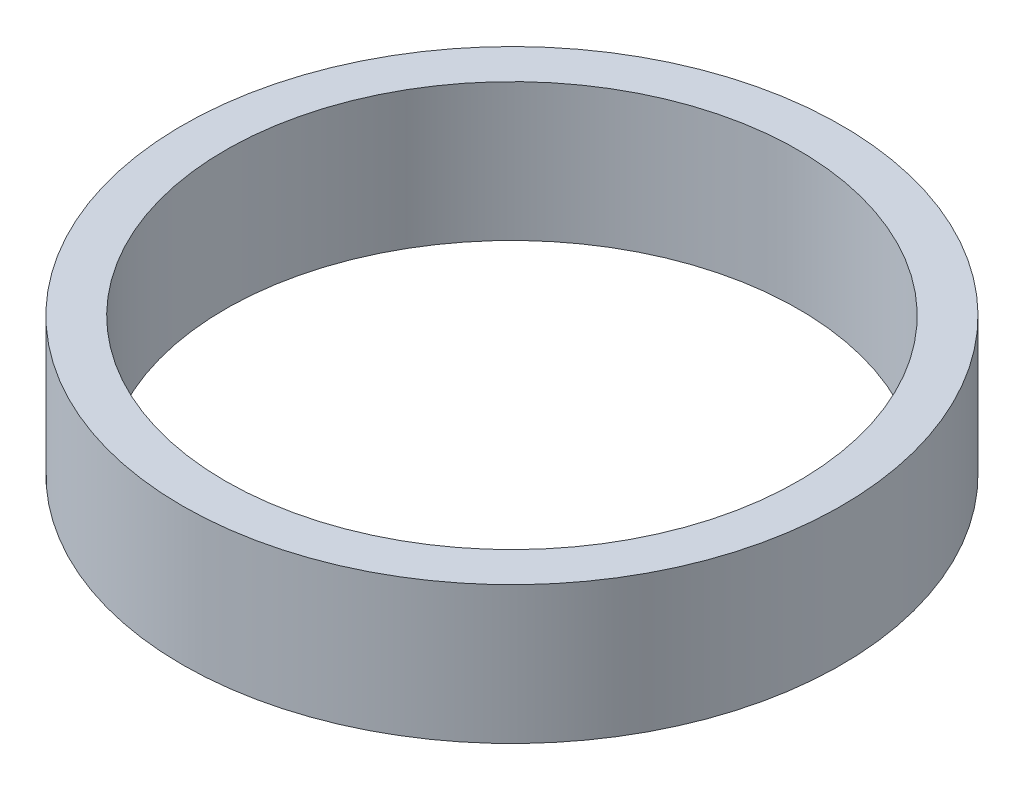
ISO-10303-21;
HEADER;
FILE_DESCRIPTION(('STEP AP214'),'2;1');
FILE_NAME('part.step','',(''),(''),'','','');
FILE_SCHEMA(('AUTOMOTIVE_DESIGN { 1 0 10303 214 1 1 1 1 }'));
ENDSEC;
DATA;
#1=APPLICATION_CONTEXT('core data for automotive mechanical design processes');
#2=APPLICATION_PROTOCOL_DEFINITION('international standard','automotive_design',2000,#1);
#3=PRODUCT_CONTEXT('',#1,'mechanical');
#4=PRODUCT('Part','Part','',(#3));
#5=PRODUCT_RELATED_PRODUCT_CATEGORY('part','',(#4));
#6=PRODUCT_DEFINITION_FORMATION('','',#4);
#7=PRODUCT_DEFINITION_CONTEXT('part definition',#1,'design');
#8=PRODUCT_DEFINITION('design','',#6,#7);
#9=PRODUCT_DEFINITION_SHAPE('','',#8);
#10=(LENGTH_UNIT() NAMED_UNIT(*) SI_UNIT(.MILLI.,.METRE.));
#11=(NAMED_UNIT(*) PLANE_ANGLE_UNIT() SI_UNIT($,.RADIAN.));
#12=(NAMED_UNIT(*) SI_UNIT($,.STERADIAN.) SOLID_ANGLE_UNIT());
#13=UNCERTAINTY_MEASURE_WITH_UNIT(LENGTH_MEASURE(1.E-05),#10,'distance_accuracy_value','');
#14=(GEOMETRIC_REPRESENTATION_CONTEXT(3) GLOBAL_UNCERTAINTY_ASSIGNED_CONTEXT((#13)) GLOBAL_UNIT_ASSIGNED_CONTEXT((#10,
#11,#12)) REPRESENTATION_CONTEXT('',''));
#15=CARTESIAN_POINT('',(0.,0.,0.));
#16=DIRECTION('',(0.,0.,1.));
#17=DIRECTION('',(1.,0.,0.));
#18=AXIS2_PLACEMENT_3D('',#15,#16,#17);
#19=CARTESIAN_POINT('',(0.,24.,0.));
#20=DIRECTION('',(0.,-1.,0.));
#21=DIRECTION('',(0.,0.,-1.));
#22=AXIS2_PLACEMENT_3D('',#19,#20,#21);
#23=CYLINDRICAL_SURFACE('',#22,57.5);
#24=CARTESIAN_POINT('',(0.,24.,0.));
#25=DIRECTION('',(0.,1.,0.));
#26=DIRECTION('',(0.,0.,1.));
#27=AXIS2_PLACEMENT_3D('',#24,#25,#26);
#28=CIRCLE('',#27,57.5);
#29=CARTESIAN_POINT('',(0.,24.,57.5));
#30=VERTEX_POINT('',#29);
#31=EDGE_CURVE('E10',#30,#30,#28,.T.);
#32=ORIENTED_EDGE('',*,*,#31,.F.);
#33=EDGE_LOOP('',(#32));
#34=FACE_BOUND('',#33,.T.);
#35=CARTESIAN_POINT('',(0.,0.,0.));
#36=DIRECTION('',(0.,1.,0.));
#37=DIRECTION('',(0.,0.,1.));
#38=AXIS2_PLACEMENT_3D('',#35,#36,#37);
#39=CIRCLE('',#38,57.5);
#40=CARTESIAN_POINT('',(0.,0.,57.5));
#41=VERTEX_POINT('',#40);
#42=EDGE_CURVE('E37',#41,#41,#39,.T.);
#43=ORIENTED_EDGE('',*,*,#42,.T.);
#44=EDGE_LOOP('',(#43));
#45=FACE_BOUND('',#44,.T.);
#46=ADVANCED_FACE('F40',(#34,#45),#23,.T.);
#47=CARTESIAN_POINT('',(0.,24.,0.));
#48=DIRECTION('',(0.,1.,0.));
#49=DIRECTION('',(0.,0.,1.));
#50=AXIS2_PLACEMENT_3D('',#47,#48,#49);
#51=PLANE('',#50);
#52=CARTESIAN_POINT('',(0.,24.,0.));
#53=DIRECTION('',(0.,1.,0.));
#54=DIRECTION('',(0.,0.,1.));
#55=AXIS2_PLACEMENT_3D('',#52,#53,#54);
#56=CIRCLE('',#55,50.);
#57=CARTESIAN_POINT('',(0.,24.,50.));
#58=VERTEX_POINT('',#57);
#59=EDGE_CURVE('E50',#58,#58,#56,.T.);
#60=ORIENTED_EDGE('',*,*,#59,.F.);
#61=EDGE_LOOP('',(#60));
#62=FACE_BOUND('',#61,.T.);
#63=ORIENTED_EDGE('',*,*,#31,.T.);
#64=EDGE_LOOP('',(#63));
#65=FACE_BOUND('',#64,.T.);
#66=ADVANCED_FACE('F59',(#62,#65),#51,.T.);
#67=CARTESIAN_POINT('',(0.,0.,0.));
#68=DIRECTION('',(0.,1.,0.));
#69=DIRECTION('',(0.,0.,1.));
#70=AXIS2_PLACEMENT_3D('',#67,#68,#69);
#71=PLANE('',#70);
#72=CARTESIAN_POINT('',(0.,0.,0.));
#73=DIRECTION('',(0.,1.,0.));
#74=DIRECTION('',(0.,0.,1.));
#75=AXIS2_PLACEMENT_3D('',#72,#73,#74);
#76=CIRCLE('',#75,50.);
#77=CARTESIAN_POINT('',(0.,0.,50.));
#78=VERTEX_POINT('',#77);
#79=EDGE_CURVE('E47',#78,#78,#76,.T.);
#80=ORIENTED_EDGE('',*,*,#79,.T.);
#81=EDGE_LOOP('',(#80));
#82=FACE_BOUND('',#81,.T.);
#83=ORIENTED_EDGE('',*,*,#42,.F.);
#84=EDGE_LOOP('',(#83));
#85=FACE_BOUND('',#84,.T.);
#86=ADVANCED_FACE('F58',(#82,#85),#71,.F.);
#87=CARTESIAN_POINT('',(0.,24.,0.));
#88=DIRECTION('',(0.,-1.,0.));
#89=DIRECTION('',(0.,0.,-1.));
#90=AXIS2_PLACEMENT_3D('',#87,#88,#89);
#91=CYLINDRICAL_SURFACE('',#90,50.);
#92=ORIENTED_EDGE('',*,*,#59,.T.);
#93=EDGE_LOOP('',(#92));
#94=FACE_BOUND('',#93,.T.);
#95=ORIENTED_EDGE('',*,*,#79,.F.);
#96=EDGE_LOOP('',(#95));
#97=FACE_BOUND('',#96,.T.);
#98=ADVANCED_FACE('F54',(#94,#97),#91,.F.);
#99=CLOSED_SHELL('',(#46,#66,#86,#98));
#100=MANIFOLD_SOLID_BREP('B2',#99);
#101=ADVANCED_BREP_SHAPE_REPRESENTATION('',(#18,#100),#14);
#102=SHAPE_DEFINITION_REPRESENTATION(#9,#101);
ENDSEC;
END-ISO-10303-21;
